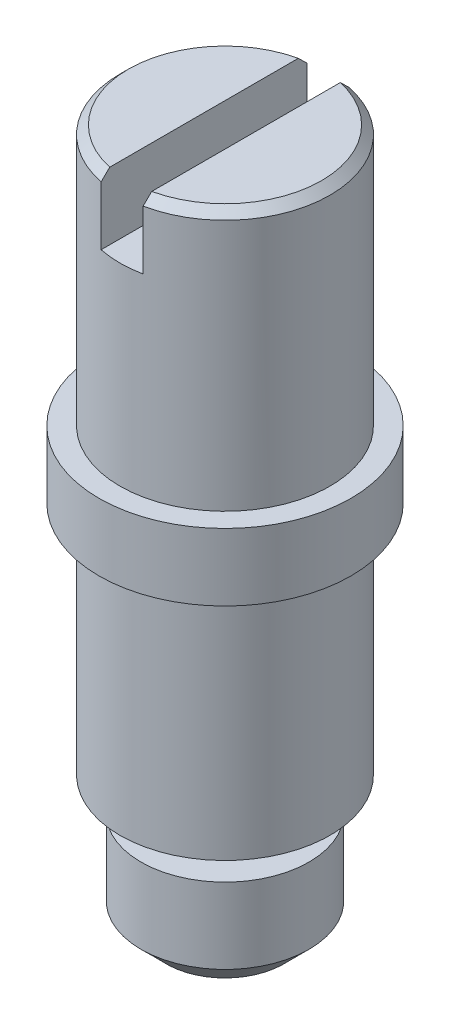
ISO-10303-21;
HEADER;
FILE_DESCRIPTION(('STEP AP214'),'2;1');
FILE_NAME('part.step','',(''),(''),'','','');
FILE_SCHEMA(('AUTOMOTIVE_DESIGN { 1 0 10303 214 1 1 1 1 }'));
ENDSEC;
DATA;
#1=APPLICATION_CONTEXT('core data for automotive mechanical design processes');
#2=APPLICATION_PROTOCOL_DEFINITION('international standard','automotive_design',2000,#1);
#3=PRODUCT_CONTEXT('',#1,'mechanical');
#4=PRODUCT('Part','Part','',(#3));
#5=PRODUCT_RELATED_PRODUCT_CATEGORY('part','',(#4));
#6=PRODUCT_DEFINITION_FORMATION('','',#4);
#7=PRODUCT_DEFINITION_CONTEXT('part definition',#1,'design');
#8=PRODUCT_DEFINITION('design','',#6,#7);
#9=PRODUCT_DEFINITION_SHAPE('','',#8);
#10=(LENGTH_UNIT() NAMED_UNIT(*) SI_UNIT(.MILLI.,.METRE.));
#11=(NAMED_UNIT(*) PLANE_ANGLE_UNIT() SI_UNIT($,.RADIAN.));
#12=(NAMED_UNIT(*) SI_UNIT($,.STERADIAN.) SOLID_ANGLE_UNIT());
#13=UNCERTAINTY_MEASURE_WITH_UNIT(LENGTH_MEASURE(1.E-05),#10,'distance_accuracy_value','');
#14=(GEOMETRIC_REPRESENTATION_CONTEXT(3) GLOBAL_UNCERTAINTY_ASSIGNED_CONTEXT((#13)) GLOBAL_UNIT_ASSIGNED_CONTEXT((#10,
#11,#12)) REPRESENTATION_CONTEXT('',''));
#15=CARTESIAN_POINT('',(0.,0.,0.));
#16=DIRECTION('',(0.,0.,1.));
#17=DIRECTION('',(1.,0.,0.));
#18=AXIS2_PLACEMENT_3D('',#15,#16,#17);
#19=CARTESIAN_POINT('',(0.,1.95,0.));
#20=DIRECTION('',(0.,1.,0.));
#21=DIRECTION('',(0.,0.,1.));
#22=AXIS2_PLACEMENT_3D('',#19,#20,#21);
#23=PLANE('',#22);
#24=DIRECTION('',(0.,0.,-1.));
#25=VECTOR('',#24,1.);
#26=CARTESIAN_POINT('',(0.125000000000473,1.95,0.));
#27=LINE('',#26,#25);
#28=CARTESIAN_POINT('',(0.125000000000473,1.95,0.561248608015992));
#29=VERTEX_POINT('',#28);
#30=CARTESIAN_POINT('',(0.125000000000473,1.95,-0.561248608015992));
#31=VERTEX_POINT('',#30);
#32=EDGE_CURVE('E108',#29,#31,#27,.T.);
#33=ORIENTED_EDGE('',*,*,#32,.F.);
#34=CARTESIAN_POINT('',(0.,1.95,0.));
#35=DIRECTION('',(0.,1.,0.));
#36=DIRECTION('',(0.,0.,1.));
#37=AXIS2_PLACEMENT_3D('',#34,#35,#36);
#38=CIRCLE('',#37,0.575000000000006);
#39=EDGE_CURVE('E142',#29,#31,#38,.T.);
#40=ORIENTED_EDGE('',*,*,#39,.T.);
#41=EDGE_LOOP('',(#33,#40));
#42=FACE_BOUND('',#41,.T.);
#43=ADVANCED_FACE('F35',(#42),#23,.T.);
#44=CARTESIAN_POINT('',(0.,1.95,0.));
#45=DIRECTION('',(0.,-1.,0.));
#46=DIRECTION('',(0.,0.,-1.));
#47=AXIS2_PLACEMENT_3D('',#44,#45,#46);
#48=CONICAL_SURFACE('',#47,0.575000000000006,0.785398163397429);
#49=CARTESIAN_POINT('',(0.124999999999504,1.14920023980819,1.37010947743014));
#50=CARTESIAN_POINT('',(0.124999999999563,1.19813925706976,1.32096535878509));
#51=CARTESIAN_POINT('',(0.124999999999623,1.24706910985686,1.27181210608696));
#52=CARTESIAN_POINT('',(0.124999999999741,1.34490137817036,1.17347092089726));
#53=CARTESIAN_POINT('',(0.1249999999998,1.39380379134596,1.12428298606726));
#54=CARTESIAN_POINT('',(0.124999999999919,1.49165381911216,1.02577370062475));
#55=CARTESIAN_POINT('',(0.124999999999978,1.54060135349721,0.976452270293644));
#56=CARTESIAN_POINT('',(0.125000000000096,1.63842388791167,0.877744738503724));
#57=CARTESIAN_POINT('',(0.125000000000155,1.68729889300122,0.82835864205731));
#58=CARTESIAN_POINT('',(0.12500000000027,1.78175158585535,0.732699162002811));
#59=CARTESIAN_POINT('',(0.125000000000325,1.82733641615014,0.686432850704182));
#60=CARTESIAN_POINT('',(0.125000000000435,1.91833456214442,0.593713312110685));
#61=CARTESIAN_POINT('',(0.12500000000049,1.96374783985771,0.547260047640846));
#62=CARTESIAN_POINT('',(0.125000000000599,2.05418680200311,0.4540685091142));
#63=CARTESIAN_POINT('',(0.125000000000654,2.0992128432814,0.407330585455441));
#64=CARTESIAN_POINT('',(0.125000000000735,2.16604495298511,0.336570398827332));
#65=CARTESIAN_POINT('',(0.125000000000761,2.18820082400338,0.312878833207356));
#66=CARTESIAN_POINT('',(0.125000000000815,2.2320744707954,0.265094526575555));
#67=CARTESIAN_POINT('',(0.125000000000841,2.25379232224936,0.241001856202001));
#68=CARTESIAN_POINT('',(0.125000000000874,2.28096027206122,0.209622065774934));
#69=CARTESIAN_POINT('',(0.125000000000881,2.2868617520767,0.202728006622168));
#70=CARTESIAN_POINT('',(0.125000000000895,2.2985589960663,0.18885069769251));
#71=CARTESIAN_POINT('',(0.125000000000902,2.30435475004815,0.181867439590297));
#72=CARTESIAN_POINT('',(0.125000000000923,2.3216761655726,0.16057673871551));
#73=CARTESIAN_POINT('',(0.125000000000937,2.33299263231736,0.146091048109113));
#74=CARTESIAN_POINT('',(0.125000000000963,2.35470835851688,0.116131602097155));
#75=CARTESIAN_POINT('',(0.125000000000975,2.36509161326945,0.100646418070848));
#76=CARTESIAN_POINT('',(0.125000000000997,2.38320299015672,0.0682506384708185));
#77=CARTESIAN_POINT('',(0.125000000001007,2.39096994603813,0.0513659991324243));
#78=CARTESIAN_POINT('',(0.125000000001015,2.39769920737644,0.0253367028381165));
#79=CARTESIAN_POINT('',(0.125000000001017,2.39914946510992,0.0168959333370034));
#80=CARTESIAN_POINT('',(0.125000000001018,2.40028617581965,-8.82002730465613E-05));
#81=CARTESIAN_POINT('',(0.125000000001018,2.39997757253231,-0.00863120953627907));
#82=CARTESIAN_POINT('',(0.125000000001015,2.39771539834452,-0.0254103732522258));
#83=CARTESIAN_POINT('',(0.125000000001013,2.39577468286381,-0.0336484020361222));
#84=CARTESIAN_POINT('',(0.125000000001006,2.39067653556003,-0.0497660111493287));
#85=CARTESIAN_POINT('',(0.125000000001003,2.38751243361168,-0.0576433569439128));
#86=CARTESIAN_POINT('',(0.12500000000099,2.37686536081511,-0.0806644358477212));
#87=CARTESIAN_POINT('',(0.125000000000979,2.36821575785989,-0.0952475290988303));
#88=CARTESIAN_POINT('',(0.125000000000957,2.3495665634523,-0.123541315153752));
#89=CARTESIAN_POINT('',(0.125000000000945,2.3395606840882,-0.137247478643869));
#90=CARTESIAN_POINT('',(0.125000000000919,2.3187587800435,-0.164271409376331));
#91=CARTESIAN_POINT('',(0.125000000000906,2.3079557324732,-0.177583783948934));
#92=CARTESIAN_POINT('',(0.12500000000088,2.28598851240675,-0.203843609727401));
#93=CARTESIAN_POINT('',(0.125000000000866,2.27482531869447,-0.21679189610544));
#94=CARTESIAN_POINT('',(0.125000000000826,2.24158363193257,-0.25464843627349));
#95=CARTESIAN_POINT('',(0.125000000000799,2.21917986149421,-0.279270321904091));
#96=CARTESIAN_POINT('',(0.125000000000744,2.173970472164,-0.328143445182345));
#97=CARTESIAN_POINT('',(0.125000000000717,2.15116479279806,-0.352394626008076));
#98=CARTESIAN_POINT('',(0.125000000000633,2.08241023327116,-0.424854189761547));
#99=CARTESIAN_POINT('',(0.125000000000577,2.03613678705424,-0.472754441191856));
#100=CARTESIAN_POINT('',(0.125000000000465,1.94320016817403,-0.568311993817129));
#101=CARTESIAN_POINT('',(0.125000000000408,1.8965365148083,-0.615968822459684));
#102=CARTESIAN_POINT('',(0.125000000000295,1.80304506255359,-0.711106878844149));
#103=CARTESIAN_POINT('',(0.125000000000239,1.75621729068014,-0.758588133065556));
#104=CARTESIAN_POINT('',(0.125000000000126,1.66296335445152,-0.852955165255983));
#105=CARTESIAN_POINT('',(0.12500000000007,1.61653818379997,-0.8998419278032));
#106=CARTESIAN_POINT('',(0.124999999999957,1.52365186294922,-0.993534437991384));
#107=CARTESIAN_POINT('',(0.124999999999901,1.47719074139269,-1.0403402140143));
#108=CARTESIAN_POINT('',(0.124999999999788,1.38383552488673,-1.13431056479134));
#109=CARTESIAN_POINT('',(0.124999999999731,1.3369411017892,-1.18147481336127));
#110=CARTESIAN_POINT('',(0.124999999999618,1.2431007431404,-1.27579873463837));
#111=CARTESIAN_POINT('',(0.124999999999561,1.19615479356856,-1.32295839339795));
#112=CARTESIAN_POINT('',(0.124999999999504,1.14920023980819,-1.37010947743014));
#113=B_SPLINE_CURVE_WITH_KNOTS('',3,(#49,#50,#51,#52,#53,#54,#55,#56,#57,#58,#59,#60,#61,#62,
#63,#64,#65,#66,#67,#68,#69,#70,#71,#72,#73,#74,#75,#76,#77,#78,#79,#80,#81,#82,#83,#84,#85,#86,
#87,#88,#89,#90,#91,#92,#93,#94,#95,#96,#97,#98,#99,#100,#101,#102,#103,#104,#105,#106,#107,
#108,#109,#110,#111,#112),.UNSPECIFIED.,.F.,.F.,(4,2,2,2,2,2,2,2,2,2,2,2,2,2,2,2,2,2,2,2,2,2,2,
2,2,2,2,2,2,2,2,4),(0.,0.208066211053667,0.416148133335245,0.624609527938355,0.833055621996165,
1.02790608855266,1.22279743061199,1.41748417585786,1.51479476238342,1.61208838918532,
1.63931202518066,1.66653822091549,1.7216410768948,1.77755731022811,1.83260267622228,
1.85813507501483,1.88359574381594,1.90885772839456,1.93425943357485,1.98491142512772,
2.03580683625388,2.08722176442011,2.1385071089796,2.23836097097024,2.33822998818645,
2.53802557446708,2.73812103573351,2.93818497630362,3.13613190806095,3.33398217164244,
3.53351155765781,3.73314020049439),.UNSPECIFIED.);
#114=CARTESIAN_POINT('',(0.125000000000413,1.9,0.61237243569571));
#115=VERTEX_POINT('',#114);
#116=EDGE_CURVE('E229',#115,#29,#113,.T.);
#117=ORIENTED_EDGE('',*,*,#116,.F.);
#118=CARTESIAN_POINT('',(0.,1.9,0.));
#119=DIRECTION('',(0.,1.,0.));
#120=DIRECTION('',(0.,0.,1.));
#121=AXIS2_PLACEMENT_3D('',#118,#119,#120);
#122=CIRCLE('',#121,0.625);
#123=CARTESIAN_POINT('',(0.125000000000413,1.9,-0.61237243569571));
#124=VERTEX_POINT('',#123);
#125=EDGE_CURVE('E145',#124,#115,#122,.F.);
#126=ORIENTED_EDGE('',*,*,#125,.F.);
#127=EDGE_CURVE('E159',#31,#124,#113,.T.);
#128=ORIENTED_EDGE('',*,*,#127,.F.);
#129=ORIENTED_EDGE('',*,*,#39,.F.);
#130=EDGE_LOOP('',(#117,#126,#128,#129));
#131=FACE_BOUND('',#130,.T.);
#132=ADVANCED_FACE('F213',(#131),#48,.T.);
#133=CARTESIAN_POINT('',(0.,0.4,0.));
#134=DIRECTION('',(0.,-1.,0.));
#135=DIRECTION('',(0.,0.,-1.));
#136=AXIS2_PLACEMENT_3D('',#133,#134,#135);
#137=CYLINDRICAL_SURFACE('',#136,0.75);
#138=CARTESIAN_POINT('',(0.,0.4,0.));
#139=DIRECTION('',(0.,1.,0.));
#140=DIRECTION('',(0.,0.,1.));
#141=AXIS2_PLACEMENT_3D('',#138,#139,#140);
#142=CIRCLE('',#141,0.75);
#143=CARTESIAN_POINT('',(0.,0.4,0.75));
#144=VERTEX_POINT('',#143);
#145=EDGE_CURVE('E133',#144,#144,#142,.T.);
#146=ORIENTED_EDGE('',*,*,#145,.F.);
#147=EDGE_LOOP('',(#146));
#148=FACE_BOUND('',#147,.T.);
#149=CARTESIAN_POINT('',(0.,0.,0.));
#150=DIRECTION('',(0.,1.,0.));
#151=DIRECTION('',(0.,0.,1.));
#152=AXIS2_PLACEMENT_3D('',#149,#150,#151);
#153=CIRCLE('',#152,0.75);
#154=CARTESIAN_POINT('',(0.,0.,0.75));
#155=VERTEX_POINT('',#154);
#156=EDGE_CURVE('E132',#155,#155,#153,.T.);
#157=ORIENTED_EDGE('',*,*,#156,.T.);
#158=EDGE_LOOP('',(#157));
#159=FACE_BOUND('',#158,.T.);
#160=ADVANCED_FACE('F208',(#148,#159),#137,.T.);
#161=CARTESIAN_POINT('',(0.,0.4,0.));
#162=DIRECTION('',(0.,1.,0.));
#163=DIRECTION('',(0.,0.,1.));
#164=AXIS2_PLACEMENT_3D('',#161,#162,#163);
#165=PLANE('',#164);
#166=CARTESIAN_POINT('',(0.,0.4,0.));
#167=DIRECTION('',(0.,1.,0.));
#168=DIRECTION('',(0.,0.,1.));
#169=AXIS2_PLACEMENT_3D('',#166,#167,#168);
#170=CIRCLE('',#169,0.625);
#171=CARTESIAN_POINT('',(0.,0.4,0.625));
#172=VERTEX_POINT('',#171);
#173=EDGE_CURVE('E127',#172,#172,#170,.T.);
#174=ORIENTED_EDGE('',*,*,#173,.F.);
#175=EDGE_LOOP('',(#174));
#176=FACE_BOUND('',#175,.T.);
#177=ORIENTED_EDGE('',*,*,#145,.T.);
#178=EDGE_LOOP('',(#177));
#179=FACE_BOUND('',#178,.T.);
#180=ADVANCED_FACE('F205',(#176,#179),#165,.T.);
#181=CARTESIAN_POINT('',(0.,0.,0.));
#182=DIRECTION('',(0.,1.,0.));
#183=DIRECTION('',(0.,0.,1.));
#184=AXIS2_PLACEMENT_3D('',#181,#182,#183);
#185=PLANE('',#184);
#186=CARTESIAN_POINT('',(0.,0.,0.));
#187=DIRECTION('',(0.,1.,0.));
#188=DIRECTION('',(0.,0.,1.));
#189=AXIS2_PLACEMENT_3D('',#186,#187,#188);
#190=CIRCLE('',#189,0.625);
#191=CARTESIAN_POINT('',(0.,0.,0.625));
#192=VERTEX_POINT('',#191);
#193=EDGE_CURVE('E123',#192,#192,#190,.T.);
#194=ORIENTED_EDGE('',*,*,#193,.T.);
#195=EDGE_LOOP('',(#194));
#196=FACE_BOUND('',#195,.T.);
#197=ORIENTED_EDGE('',*,*,#156,.F.);
#198=EDGE_LOOP('',(#197));
#199=FACE_BOUND('',#198,.T.);
#200=ADVANCED_FACE('F204',(#196,#199),#185,.F.);
#201=CARTESIAN_POINT('',(0.,1.95,0.));
#202=DIRECTION('',(0.,-1.,0.));
#203=DIRECTION('',(0.,0.,-1.));
#204=AXIS2_PLACEMENT_3D('',#201,#202,#203);
#205=CYLINDRICAL_SURFACE('',#204,0.625);
#206=CARTESIAN_POINT('',(0.,1.54999999998942,0.));
#207=DIRECTION('',(-2.96603019922527E-11,-1.,0.));
#208=DIRECTION('',(1.,-2.96603019922527E-11,0.));
#209=AXIS2_PLACEMENT_3D('',#206,#207,#208);
#210=CIRCLE('',#209,0.625);
#211=CARTESIAN_POINT('',(-0.125,1.54999999998572,-0.612372435695695));
#212=VERTEX_POINT('',#211);
#213=CARTESIAN_POINT('',(0.124999999999989,1.54999999998572,-0.612372435695797));
#214=VERTEX_POINT('',#213);
#215=EDGE_CURVE('E11',#212,#214,#210,.T.);
#216=ORIENTED_EDGE('',*,*,#215,.T.);
#217=DIRECTION('',(0.,-1.,0.));
#218=VECTOR('',#217,1.);
#219=CARTESIAN_POINT('',(0.125000000000473,1.94999999999985,-0.612372435695698));
#220=LINE('',#219,#218);
#221=EDGE_CURVE('E110',#214,#124,#220,.F.);
#222=ORIENTED_EDGE('',*,*,#221,.T.);
#223=ORIENTED_EDGE('',*,*,#125,.T.);
#224=DIRECTION('',(0.,-1.,0.));
#225=VECTOR('',#224,1.);
#226=CARTESIAN_POINT('',(0.125000000000473,1.94999999999985,0.612372435695698));
#227=LINE('',#226,#225);
#228=CARTESIAN_POINT('',(0.124999999999989,1.54999999998572,0.612372435695797));
#229=VERTEX_POINT('',#228);
#230=EDGE_CURVE('E58',#115,#229,#227,.T.);
#231=ORIENTED_EDGE('',*,*,#230,.T.);
#232=CARTESIAN_POINT('',(-0.125,1.54999999998572,0.612372435695695));
#233=VERTEX_POINT('',#232);
#234=EDGE_CURVE('E39',#229,#233,#210,.T.);
#235=ORIENTED_EDGE('',*,*,#234,.T.);
#236=DIRECTION('',(0.,-1.,0.));
#237=VECTOR('',#236,1.);
#238=CARTESIAN_POINT('',(-0.125000000000487,1.94999999999985,0.612372435695695));
#239=LINE('',#238,#237);
#240=CARTESIAN_POINT('',(-0.125000000000426,1.9,0.612372435695708));
#241=VERTEX_POINT('',#240);
#242=EDGE_CURVE('E101',#233,#241,#239,.F.);
#243=ORIENTED_EDGE('',*,*,#242,.T.);
#244=CARTESIAN_POINT('',(-0.125000000000426,1.9,-0.612372435695708));
#245=VERTEX_POINT('',#244);
#246=EDGE_CURVE('E107',#241,#245,#122,.F.);
#247=ORIENTED_EDGE('',*,*,#246,.T.);
#248=DIRECTION('',(0.,-1.,0.));
#249=VECTOR('',#248,1.);
#250=CARTESIAN_POINT('',(-0.125000000000487,1.94999999999985,-0.612372435695695));
#251=LINE('',#250,#249);
#252=EDGE_CURVE('E98',#245,#212,#251,.T.);
#253=ORIENTED_EDGE('',*,*,#252,.T.);
#254=EDGE_LOOP('',(#216,#222,#223,#231,#235,#243,#247,#253));
#255=FACE_BOUND('',#254,.T.);
#256=ORIENTED_EDGE('',*,*,#173,.T.);
#257=EDGE_LOOP('',(#256));
#258=FACE_BOUND('',#257,.T.);
#259=ADVANCED_FACE('F104',(#255,#258),#205,.T.);
#260=DIRECTION('',(0.,0.,1.));
#261=VECTOR('',#260,1.);
#262=CARTESIAN_POINT('',(-0.125000000000487,1.95,0.));
#263=LINE('',#262,#261);
#264=CARTESIAN_POINT('',(-0.125000000000487,1.95,-0.561248608015988));
#265=VERTEX_POINT('',#264);
#266=CARTESIAN_POINT('',(-0.125000000000487,1.95,0.561248608015988));
#267=VERTEX_POINT('',#266);
#268=EDGE_CURVE('E50',#265,#267,#263,.T.);
#269=ORIENTED_EDGE('',*,*,#268,.F.);
#270=EDGE_CURVE('E141',#265,#267,#38,.T.);
#271=ORIENTED_EDGE('',*,*,#270,.T.);
#272=EDGE_LOOP('',(#269,#271));
#273=FACE_BOUND('',#272,.T.);
#274=ADVANCED_FACE('F197',(#273),#23,.T.);
#275=CARTESIAN_POINT('',(0.,-1.4,0.));
#276=DIRECTION('',(0.,1.,0.));
#277=DIRECTION('',(0.,0.,1.));
#278=AXIS2_PLACEMENT_3D('',#275,#276,#277);
#279=CYLINDRICAL_SURFACE('',#278,0.625);
#280=CARTESIAN_POINT('',(0.,-1.4,0.));
#281=DIRECTION('',(0.,1.,0.));
#282=DIRECTION('',(0.,0.,1.));
#283=AXIS2_PLACEMENT_3D('',#280,#281,#282);
#284=CIRCLE('',#283,0.625);
#285=CARTESIAN_POINT('',(0.,-1.4,0.625));
#286=VERTEX_POINT('',#285);
#287=EDGE_CURVE('E124',#286,#286,#284,.T.);
#288=ORIENTED_EDGE('',*,*,#287,.T.);
#289=EDGE_LOOP('',(#288));
#290=FACE_BOUND('',#289,.T.);
#291=ORIENTED_EDGE('',*,*,#193,.F.);
#292=EDGE_LOOP('',(#291));
#293=FACE_BOUND('',#292,.T.);
#294=ADVANCED_FACE('F193',(#290,#293),#279,.T.);
#295=CARTESIAN_POINT('',(0.,-1.4,0.));
#296=DIRECTION('',(0.,1.,0.));
#297=DIRECTION('',(0.,0.,1.));
#298=AXIS2_PLACEMENT_3D('',#295,#296,#297);
#299=PLANE('',#298);
#300=CARTESIAN_POINT('',(0.,-1.4,0.));
#301=DIRECTION('',(0.,1.,0.));
#302=DIRECTION('',(0.,0.,1.));
#303=AXIS2_PLACEMENT_3D('',#300,#301,#302);
#304=CIRCLE('',#303,0.3);
#305=CARTESIAN_POINT('',(0.,-1.4,0.3));
#306=VERTEX_POINT('',#305);
#307=EDGE_CURVE('E136',#306,#306,#304,.F.);
#308=ORIENTED_EDGE('',*,*,#307,.F.);
#309=EDGE_LOOP('',(#308));
#310=FACE_BOUND('',#309,.T.);
#311=ORIENTED_EDGE('',*,*,#287,.F.);
#312=EDGE_LOOP('',(#311));
#313=FACE_BOUND('',#312,.T.);
#314=ADVANCED_FACE('F189',(#310,#313),#299,.F.);
#315=CARTESIAN_POINT('',(0.,-1.6,0.));
#316=DIRECTION('',(0.,1.,0.));
#317=DIRECTION('',(0.,0.,1.));
#318=AXIS2_PLACEMENT_3D('',#315,#316,#317);
#319=CYLINDRICAL_SURFACE('',#318,0.3);
#320=CARTESIAN_POINT('',(0.,-1.6,0.));
#321=DIRECTION('',(0.,-1.,0.));
#322=DIRECTION('',(0.,0.,-1.));
#323=AXIS2_PLACEMENT_3D('',#320,#321,#322);
#324=CIRCLE('',#323,0.3);
#325=CARTESIAN_POINT('',(0.,-1.6,-0.3));
#326=VERTEX_POINT('',#325);
#327=EDGE_CURVE('E120',#326,#326,#324,.T.);
#328=ORIENTED_EDGE('',*,*,#327,.F.);
#329=EDGE_LOOP('',(#328));
#330=FACE_BOUND('',#329,.T.);
#331=ORIENTED_EDGE('',*,*,#307,.T.);
#332=EDGE_LOOP('',(#331));
#333=FACE_BOUND('',#332,.T.);
#334=ADVANCED_FACE('F185',(#330,#333),#319,.T.);
#335=CARTESIAN_POINT('',(0.,-2.2,0.));
#336=DIRECTION('',(0.,1.,0.));
#337=DIRECTION('',(0.,0.,1.));
#338=AXIS2_PLACEMENT_3D('',#335,#336,#337);
#339=CYLINDRICAL_SURFACE('',#338,0.5);
#340=CARTESIAN_POINT('',(0.,-2.05,0.));
#341=DIRECTION('',(0.,-1.,0.));
#342=DIRECTION('',(0.,0.,-1.));
#343=AXIS2_PLACEMENT_3D('',#340,#341,#342);
#344=CIRCLE('',#343,0.5);
#345=CARTESIAN_POINT('',(0.,-2.05,-0.5));
#346=VERTEX_POINT('',#345);
#347=EDGE_CURVE('E150',#346,#346,#344,.F.);
#348=ORIENTED_EDGE('',*,*,#347,.T.);
#349=EDGE_LOOP('',(#348));
#350=FACE_BOUND('',#349,.T.);
#351=CARTESIAN_POINT('',(0.,-1.6,0.));
#352=DIRECTION('',(0.,-1.,0.));
#353=DIRECTION('',(0.,0.,-1.));
#354=AXIS2_PLACEMENT_3D('',#351,#352,#353);
#355=CIRCLE('',#354,0.5);
#356=CARTESIAN_POINT('',(0.,-1.6,-0.5));
#357=VERTEX_POINT('',#356);
#358=EDGE_CURVE('E117',#357,#357,#355,.T.);
#359=ORIENTED_EDGE('',*,*,#358,.T.);
#360=EDGE_LOOP('',(#359));
#361=FACE_BOUND('',#360,.T.);
#362=ADVANCED_FACE('F178',(#350,#361),#339,.T.);
#363=CARTESIAN_POINT('',(0.,-2.2,0.));
#364=DIRECTION('',(0.,-1.,0.));
#365=DIRECTION('',(0.,0.,-1.));
#366=AXIS2_PLACEMENT_3D('',#363,#364,#365);
#367=PLANE('',#366);
#368=CARTESIAN_POINT('',(0.,-2.2,0.));
#369=DIRECTION('',(0.,-1.,0.));
#370=DIRECTION('',(0.,0.,-1.));
#371=AXIS2_PLACEMENT_3D('',#368,#369,#370);
#372=CIRCLE('',#371,0.350000000000004);
#373=CARTESIAN_POINT('',(0.,-2.2,-0.350000000000004));
#374=VERTEX_POINT('',#373);
#375=EDGE_CURVE('E147',#374,#374,#372,.T.);
#376=ORIENTED_EDGE('',*,*,#375,.T.);
#377=EDGE_LOOP('',(#376));
#378=FACE_BOUND('',#377,.T.);
#379=ADVANCED_FACE('F174',(#378),#367,.T.);
#380=CARTESIAN_POINT('',(0.,-1.6,0.));
#381=DIRECTION('',(0.,-1.,0.));
#382=DIRECTION('',(0.,0.,-1.));
#383=AXIS2_PLACEMENT_3D('',#380,#381,#382);
#384=PLANE('',#383);
#385=ORIENTED_EDGE('',*,*,#327,.T.);
#386=EDGE_LOOP('',(#385));
#387=FACE_BOUND('',#386,.T.);
#388=ORIENTED_EDGE('',*,*,#358,.F.);
#389=EDGE_LOOP('',(#388));
#390=FACE_BOUND('',#389,.T.);
#391=ADVANCED_FACE('F177',(#387,#390),#384,.F.);
#392=CARTESIAN_POINT('',(-0.124999999999512,1.14920023980819,-1.37010947743014));
#393=CARTESIAN_POINT('',(-0.124999999999572,1.19813925706976,-1.32096535878509));
#394=CARTESIAN_POINT('',(-0.124999999999631,1.24706910985686,-1.27181210608696));
#395=CARTESIAN_POINT('',(-0.12499999999975,1.34490137817036,-1.17347092089726));
#396=CARTESIAN_POINT('',(-0.12499999999981,1.39380379134596,-1.12428298606726));
#397=CARTESIAN_POINT('',(-0.124999999999929,1.49165381911216,-1.02577370062475));
#398=CARTESIAN_POINT('',(-0.124999999999989,1.54060135349721,-0.976452270293644));
#399=CARTESIAN_POINT('',(-0.125000000000108,1.63842388791166,-0.877744738503724));
#400=CARTESIAN_POINT('',(-0.125000000000167,1.68729889300122,-0.82835864205731));
#401=CARTESIAN_POINT('',(-0.125000000000282,1.78175158585535,-0.732699162002811));
#402=CARTESIAN_POINT('',(-0.125000000000338,1.82733641615014,-0.686432850704182));
#403=CARTESIAN_POINT('',(-0.125000000000448,1.91833456214441,-0.593713312110684));
#404=CARTESIAN_POINT('',(-0.125000000000504,1.96374783985771,-0.547260047640845));
#405=CARTESIAN_POINT('',(-0.125000000000614,2.05418680200311,-0.454068509114198));
#406=CARTESIAN_POINT('',(-0.125000000000668,2.0992128432814,-0.407330585455439));
#407=CARTESIAN_POINT('',(-0.12500000000075,2.16604495298511,-0.336570398827329));
#408=CARTESIAN_POINT('',(-0.125000000000777,2.18820082400338,-0.312878833207353));
#409=CARTESIAN_POINT('',(-0.12500000000083,2.2320744707954,-0.265094526575551));
#410=CARTESIAN_POINT('',(-0.125000000000857,2.25379232224935,-0.241001856201997));
#411=CARTESIAN_POINT('',(-0.12500000000089,2.28096027206121,-0.209622065774929));
#412=CARTESIAN_POINT('',(-0.125000000000897,2.28686175207669,-0.202728006622163));
#413=CARTESIAN_POINT('',(-0.125000000000911,2.29855899606629,-0.188850697692504));
#414=CARTESIAN_POINT('',(-0.125000000000918,2.30435475004814,-0.181867439590292));
#415=CARTESIAN_POINT('',(-0.125000000000939,2.3216761655726,-0.160576738715505));
#416=CARTESIAN_POINT('',(-0.125000000000953,2.33299263231735,-0.146091048109107));
#417=CARTESIAN_POINT('',(-0.125000000000979,2.35470835851688,-0.116131602097148));
#418=CARTESIAN_POINT('',(-0.125000000000992,2.36509161326945,-0.10064641807084));
#419=CARTESIAN_POINT('',(-0.125000000001014,2.38320299015671,-0.0682506384708095));
#420=CARTESIAN_POINT('',(-0.125000000001023,2.39096994603811,-0.0513659991324146));
#421=CARTESIAN_POINT('',(-0.125000000001032,2.39769920737642,-0.0253367028381055));
#422=CARTESIAN_POINT('',(-0.125000000001033,2.3991494651099,-0.0168959333369917));
#423=CARTESIAN_POINT('',(-0.125000000001035,2.40028617581963,8.82002730594785E-05));
#424=CARTESIAN_POINT('',(-0.125000000001034,2.39997757253229,0.00863120953629247));
#425=CARTESIAN_POINT('',(-0.125000000001032,2.3977153983445,0.0254103732522399));
#426=CARTESIAN_POINT('',(-0.125000000001029,2.39577468286379,0.0336484020361366));
#427=CARTESIAN_POINT('',(-0.125000000001023,2.39067653556,0.0497660111493436));
#428=CARTESIAN_POINT('',(-0.125000000001019,2.38751243361165,0.0576433569439281));
#429=CARTESIAN_POINT('',(-0.125000000001006,2.37686536081509,0.0806644358477418));
#430=CARTESIAN_POINT('',(-0.125000000000996,2.36821575785986,0.0952475290988554));
#431=CARTESIAN_POINT('',(-0.125000000000973,2.34956656345227,0.123541315153786));
#432=CARTESIAN_POINT('',(-0.125000000000961,2.33956068408816,0.137247478643908));
#433=CARTESIAN_POINT('',(-0.125000000000936,2.31875878004345,0.164271409376378));
#434=CARTESIAN_POINT('',(-0.125000000000922,2.30795573247315,0.177583783948986));
#435=CARTESIAN_POINT('',(-0.125000000000896,2.28598851240669,0.203843609727461));
#436=CARTESIAN_POINT('',(-0.125000000000882,2.27482531869441,0.216791896105504));
#437=CARTESIAN_POINT('',(-0.125000000000842,2.2415836319325,0.254648436273566));
#438=CARTESIAN_POINT('',(-0.125000000000814,2.21917986149413,0.279270321904175));
#439=CARTESIAN_POINT('',(-0.125000000000759,2.1739704721639,0.328143445182445));
#440=CARTESIAN_POINT('',(-0.125000000000732,2.15116479279795,0.352394626008184));
#441=CARTESIAN_POINT('',(-0.125000000000648,2.08241023327103,0.424854189761679));
#442=CARTESIAN_POINT('',(-0.125000000000592,2.03613678705409,0.472754441192004));
#443=CARTESIAN_POINT('',(-0.125000000000479,1.94320016817385,0.568311993817309));
#444=CARTESIAN_POINT('',(-0.125000000000422,1.89653651480811,0.615968822459881));
#445=CARTESIAN_POINT('',(-0.125000000000308,1.80304506255336,0.711106878844378));
#446=CARTESIAN_POINT('',(-0.125000000000251,1.75621729067989,0.758588133065801));
#447=CARTESIAN_POINT('',(-0.125000000000138,1.66296335445129,0.852955165256223));
#448=CARTESIAN_POINT('',(-0.125000000000081,1.61653818379975,0.899841927803418));
#449=CARTESIAN_POINT('',(-0.124999999999968,1.52365186294904,0.993534437991559));
#450=CARTESIAN_POINT('',(-0.124999999999911,1.47719074139254,1.04034021401445));
#451=CARTESIAN_POINT('',(-0.124999999999798,1.38383552488662,1.13431056479145));
#452=CARTESIAN_POINT('',(-0.124999999999741,1.33694110178912,1.18147481336136));
#453=CARTESIAN_POINT('',(-0.124999999999626,1.24310074314036,1.27579873463842));
#454=CARTESIAN_POINT('',(-0.124999999999569,1.19615479356854,1.32295839339797));
#455=CARTESIAN_POINT('',(-0.124999999999512,1.14920023980819,1.37010947743014));
#456=B_SPLINE_CURVE_WITH_KNOTS('',3,(#392,#393,#394,#395,#396,#397,#398,#399,#400,#401,#402,
#403,#404,#405,#406,#407,#408,#409,#410,#411,#412,#413,#414,#415,#416,#417,#418,#419,#420,#421,
#422,#423,#424,#425,#426,#427,#428,#429,#430,#431,#432,#433,#434,#435,#436,#437,#438,#439,#440,
#441,#442,#443,#444,#445,#446,#447,#448,#449,#450,#451,#452,#453,#454,#455),.UNSPECIFIED.,.F.,
.F.,(4,2,2,2,2,2,2,2,2,2,2,2,2,2,2,2,2,2,2,2,2,2,2,2,2,2,2,2,2,2,2,4),(0.,0.208066211053668,
0.416148133335245,0.624609527938355,0.833055621996166,1.02790608855266,1.22279743061199,
1.41748417585786,1.51479476238342,1.61208838918533,1.63931202518066,1.66653822091549,
1.7216410768948,1.77755731022811,1.83260267622228,1.85813507501483,1.88359574381595,
1.90885772839457,1.93425943357486,1.98491142512775,2.03580683625392,2.08722176442017,
2.13850710897968,2.23836097097035,2.3382299881866,2.5380255744673,2.7381210357338,
2.93818497630397,3.13613190806121,3.33398217164261,3.53351155765789,3.73314020049437),.UNSPECIFIED.);
#457=EDGE_CURVE('E158',#245,#265,#456,.T.);
#458=ORIENTED_EDGE('',*,*,#457,.F.);
#459=ORIENTED_EDGE('',*,*,#246,.F.);
#460=EDGE_CURVE('E153',#267,#241,#456,.T.);
#461=ORIENTED_EDGE('',*,*,#460,.F.);
#462=ORIENTED_EDGE('',*,*,#270,.F.);
#463=EDGE_LOOP('',(#458,#459,#461,#462));
#464=FACE_BOUND('',#463,.T.);
#465=ADVANCED_FACE('F164',(#464),#48,.T.);
#466=CARTESIAN_POINT('',(0.,-2.2,0.));
#467=DIRECTION('',(0.,1.,0.));
#468=DIRECTION('',(0.,0.,1.));
#469=AXIS2_PLACEMENT_3D('',#466,#467,#468);
#470=CONICAL_SURFACE('',#469,0.350000000000004,0.78539816339743);
#471=ORIENTED_EDGE('',*,*,#347,.F.);
#472=EDGE_LOOP('',(#471));
#473=FACE_BOUND('',#472,.T.);
#474=ORIENTED_EDGE('',*,*,#375,.F.);
#475=EDGE_LOOP('',(#474));
#476=FACE_BOUND('',#475,.T.);
#477=ADVANCED_FACE('F37',(#473,#476),#470,.T.);
#478=CARTESIAN_POINT('',(0.124999999999989,1.54999999998572,-0.75));
#479=DIRECTION('',(-2.96603019922527E-11,-1.,0.));
#480=DIRECTION('',(1.,-2.96603019922527E-11,0.));
#481=AXIS2_PLACEMENT_3D('',#478,#479,#480);
#482=PLANE('',#481);
#483=DIRECTION('',(0.,0.,1.));
#484=VECTOR('',#483,1.);
#485=CARTESIAN_POINT('',(0.124999999999989,1.54999999998572,-0.75));
#486=LINE('',#485,#484);
#487=EDGE_CURVE('E93',#214,#229,#486,.T.);
#488=ORIENTED_EDGE('',*,*,#487,.F.);
#489=ORIENTED_EDGE('',*,*,#215,.F.);
#490=DIRECTION('',(0.,0.,1.));
#491=VECTOR('',#490,1.);
#492=CARTESIAN_POINT('',(-0.125,1.54999999998572,-0.75));
#493=LINE('',#492,#491);
#494=EDGE_CURVE('E91',#212,#233,#493,.T.);
#495=ORIENTED_EDGE('',*,*,#494,.T.);
#496=ORIENTED_EDGE('',*,*,#234,.F.);
#497=EDGE_LOOP('',(#488,#489,#495,#496));
#498=FACE_BOUND('',#497,.T.);
#499=ADVANCED_FACE('F90',(#498),#482,.F.);
#500=CARTESIAN_POINT('',(0.125000000000693,2.13164345879591,-0.75));
#501=DIRECTION('',(1.,-1.21003654319208E-12,0.));
#502=DIRECTION('',(1.21003654319208E-12,1.,0.));
#503=AXIS2_PLACEMENT_3D('',#500,#501,#502);
#504=PLANE('',#503);
#505=ORIENTED_EDGE('',*,*,#116,.T.);
#506=ORIENTED_EDGE('',*,*,#32,.T.);
#507=ORIENTED_EDGE('',*,*,#127,.T.);
#508=ORIENTED_EDGE('',*,*,#221,.F.);
#509=ORIENTED_EDGE('',*,*,#487,.T.);
#510=ORIENTED_EDGE('',*,*,#230,.F.);
#511=EDGE_LOOP('',(#505,#506,#507,#508,#509,#510));
#512=FACE_BOUND('',#511,.T.);
#513=ADVANCED_FACE('F170',(#512),#504,.F.);
#514=CARTESIAN_POINT('',(-0.125000000000708,2.13164345879591,-0.75));
#515=DIRECTION('',(-1.,-1.2170266641764E-12,0.));
#516=DIRECTION('',(1.2170266641764E-12,-1.,0.));
#517=AXIS2_PLACEMENT_3D('',#514,#515,#516);
#518=PLANE('',#517);
#519=ORIENTED_EDGE('',*,*,#457,.T.);
#520=ORIENTED_EDGE('',*,*,#268,.T.);
#521=ORIENTED_EDGE('',*,*,#460,.T.);
#522=ORIENTED_EDGE('',*,*,#242,.F.);
#523=ORIENTED_EDGE('',*,*,#494,.F.);
#524=ORIENTED_EDGE('',*,*,#252,.F.);
#525=EDGE_LOOP('',(#519,#520,#521,#522,#523,#524));
#526=FACE_BOUND('',#525,.T.);
#527=ADVANCED_FACE('F97',(#526),#518,.F.);
#528=CLOSED_SHELL('',(#43,#132,#160,#180,#200,#259,#274,#294,#314,#334,#362,#379,#391,#465,#477,
#499,#513,#527));
#529=MANIFOLD_SOLID_BREP('B2',#528);
#530=ADVANCED_BREP_SHAPE_REPRESENTATION('',(#18,#529),#14);
#531=SHAPE_DEFINITION_REPRESENTATION(#9,#530);
ENDSEC;
END-ISO-10303-21;
